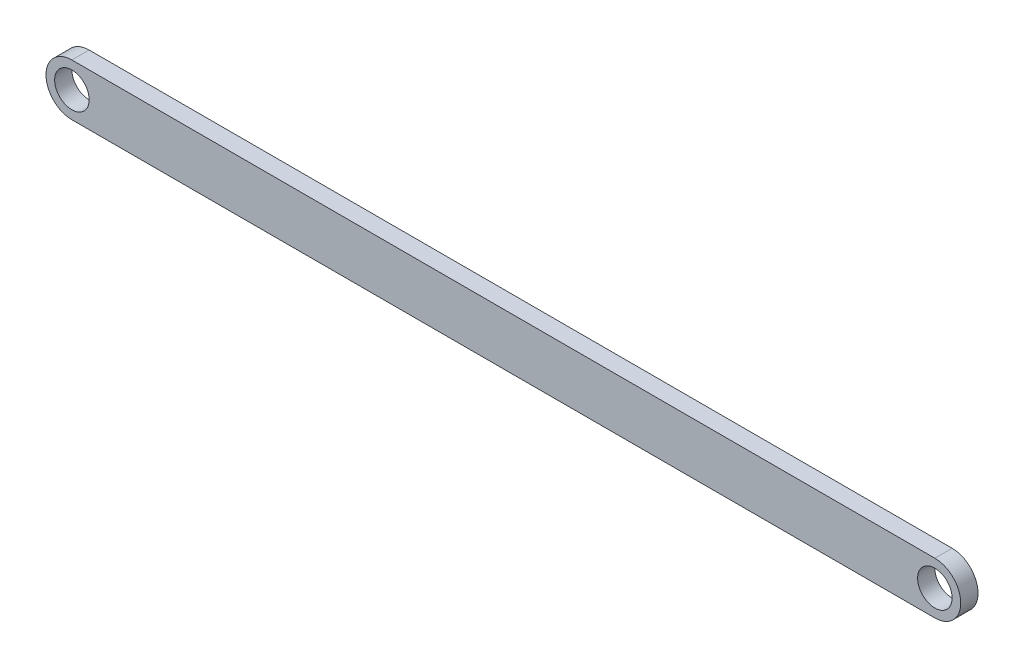
ISO-10303-21;
HEADER;
FILE_DESCRIPTION(('STEP AP214'),'2;1');
FILE_NAME('part.step','',(''),(''),'','','');
FILE_SCHEMA(('AUTOMOTIVE_DESIGN { 1 0 10303 214 1 1 1 1 }'));
ENDSEC;
DATA;
#1=APPLICATION_CONTEXT('core data for automotive mechanical design processes');
#2=APPLICATION_PROTOCOL_DEFINITION('international standard','automotive_design',2000,#1);
#3=PRODUCT_CONTEXT('',#1,'mechanical');
#4=PRODUCT('Part','Part','',(#3));
#5=PRODUCT_RELATED_PRODUCT_CATEGORY('part','',(#4));
#6=PRODUCT_DEFINITION_FORMATION('','',#4);
#7=PRODUCT_DEFINITION_CONTEXT('part definition',#1,'design');
#8=PRODUCT_DEFINITION('design','',#6,#7);
#9=PRODUCT_DEFINITION_SHAPE('','',#8);
#10=(LENGTH_UNIT() NAMED_UNIT(*) SI_UNIT(.MILLI.,.METRE.));
#11=(NAMED_UNIT(*) PLANE_ANGLE_UNIT() SI_UNIT($,.RADIAN.));
#12=(NAMED_UNIT(*) SI_UNIT($,.STERADIAN.) SOLID_ANGLE_UNIT());
#13=UNCERTAINTY_MEASURE_WITH_UNIT(LENGTH_MEASURE(1.E-05),#10,'distance_accuracy_value','');
#14=(GEOMETRIC_REPRESENTATION_CONTEXT(3) GLOBAL_UNCERTAINTY_ASSIGNED_CONTEXT((#13)) GLOBAL_UNIT_ASSIGNED_CONTEXT((#10,
#11,#12)) REPRESENTATION_CONTEXT('',''));
#15=CARTESIAN_POINT('',(0.,0.,0.));
#16=DIRECTION('',(0.,0.,1.));
#17=DIRECTION('',(1.,0.,0.));
#18=AXIS2_PLACEMENT_3D('',#15,#16,#17);
#19=CARTESIAN_POINT('',(-51.9553359155506,0.,2.));
#20=DIRECTION('',(0.,0.,1.));
#21=DIRECTION('',(1.,0.,0.));
#22=AXIS2_PLACEMENT_3D('',#19,#20,#21);
#23=PLANE('',#22);
#24=CARTESIAN_POINT('',(48.0446640844494,0.,2.));
#25=DIRECTION('',(0.,0.,1.));
#26=DIRECTION('',(1.,0.,0.));
#27=AXIS2_PLACEMENT_3D('',#24,#25,#26);
#28=CIRCLE('',#27,2.);
#29=CARTESIAN_POINT('',(50.0446640844494,0.,2.));
#30=VERTEX_POINT('',#29);
#31=EDGE_CURVE('E98',#30,#30,#28,.T.);
#32=ORIENTED_EDGE('',*,*,#31,.F.);
#33=EDGE_LOOP('',(#32));
#34=FACE_BOUND('',#33,.T.);
#35=CARTESIAN_POINT('',(-51.9553359155506,0.,2.));
#36=DIRECTION('',(0.,0.,1.));
#37=DIRECTION('',(1.,0.,0.));
#38=AXIS2_PLACEMENT_3D('',#35,#36,#37);
#39=CIRCLE('',#38,3.);
#40=CARTESIAN_POINT('',(-51.9553359155506,3.,2.));
#41=VERTEX_POINT('',#40);
#42=CARTESIAN_POINT('',(-51.9553359155506,-3.,2.));
#43=VERTEX_POINT('',#42);
#44=EDGE_CURVE('E83',#41,#43,#39,.T.);
#45=ORIENTED_EDGE('',*,*,#44,.T.);
#46=DIRECTION('',(1.,0.,0.));
#47=VECTOR('',#46,1.);
#48=CARTESIAN_POINT('',(-51.9553359155506,-3.,2.));
#49=LINE('',#48,#47);
#50=CARTESIAN_POINT('',(48.0446640844494,-3.,2.));
#51=VERTEX_POINT('',#50);
#52=EDGE_CURVE('E78',#43,#51,#49,.T.);
#53=ORIENTED_EDGE('',*,*,#52,.T.);
#54=CARTESIAN_POINT('',(48.0446640844494,0.,2.));
#55=DIRECTION('',(0.,0.,1.));
#56=DIRECTION('',(1.,0.,0.));
#57=AXIS2_PLACEMENT_3D('',#54,#55,#56);
#58=CIRCLE('',#57,3.);
#59=CARTESIAN_POINT('',(48.0446640844494,3.,2.));
#60=VERTEX_POINT('',#59);
#61=EDGE_CURVE('E81',#51,#60,#58,.T.);
#62=ORIENTED_EDGE('',*,*,#61,.T.);
#63=DIRECTION('',(-1.,0.,0.));
#64=VECTOR('',#63,1.);
#65=CARTESIAN_POINT('',(-51.9553359155506,3.,2.));
#66=LINE('',#65,#64);
#67=EDGE_CURVE('E48',#60,#41,#66,.T.);
#68=ORIENTED_EDGE('',*,*,#67,.T.);
#69=EDGE_LOOP('',(#45,#53,#62,#68));
#70=FACE_BOUND('',#69,.T.);
#71=CARTESIAN_POINT('',(-51.9553359155506,0.,2.));
#72=DIRECTION('',(0.,0.,1.));
#73=DIRECTION('',(1.,0.,0.));
#74=AXIS2_PLACEMENT_3D('',#71,#72,#73);
#75=CIRCLE('',#74,2.);
#76=CARTESIAN_POINT('',(-49.9553359155506,0.,2.));
#77=VERTEX_POINT('',#76);
#78=EDGE_CURVE('E113',#77,#77,#75,.T.);
#79=ORIENTED_EDGE('',*,*,#78,.F.);
#80=EDGE_LOOP('',(#79));
#81=FACE_BOUND('',#80,.T.);
#82=ADVANCED_FACE('F31',(#34,#70,#81),#23,.T.);
#83=CARTESIAN_POINT('',(-51.9553359155506,0.,0.));
#84=DIRECTION('',(0.,0.,1.));
#85=DIRECTION('',(1.,0.,0.));
#86=AXIS2_PLACEMENT_3D('',#83,#84,#85);
#87=PLANE('',#86);
#88=CARTESIAN_POINT('',(48.0446640844494,0.,0.));
#89=DIRECTION('',(0.,0.,1.));
#90=DIRECTION('',(1.,0.,0.));
#91=AXIS2_PLACEMENT_3D('',#88,#89,#90);
#92=CIRCLE('',#91,2.);
#93=CARTESIAN_POINT('',(50.0446640844494,0.,0.));
#94=VERTEX_POINT('',#93);
#95=EDGE_CURVE('E110',#94,#94,#92,.T.);
#96=ORIENTED_EDGE('',*,*,#95,.T.);
#97=EDGE_LOOP('',(#96));
#98=FACE_BOUND('',#97,.T.);
#99=CARTESIAN_POINT('',(-51.9553359155506,0.,0.));
#100=DIRECTION('',(0.,0.,1.));
#101=DIRECTION('',(1.,0.,0.));
#102=AXIS2_PLACEMENT_3D('',#99,#100,#101);
#103=CIRCLE('',#102,3.);
#104=CARTESIAN_POINT('',(-51.9553359155506,3.,0.));
#105=VERTEX_POINT('',#104);
#106=CARTESIAN_POINT('',(-51.9553359155506,-3.,0.));
#107=VERTEX_POINT('',#106);
#108=EDGE_CURVE('E95',#105,#107,#103,.T.);
#109=ORIENTED_EDGE('',*,*,#108,.F.);
#110=DIRECTION('',(-1.,0.,0.));
#111=VECTOR('',#110,1.);
#112=CARTESIAN_POINT('',(-51.9553359155506,3.,0.));
#113=LINE('',#112,#111);
#114=CARTESIAN_POINT('',(48.0446640844494,3.,0.));
#115=VERTEX_POINT('',#114);
#116=EDGE_CURVE('E71',#115,#105,#113,.T.);
#117=ORIENTED_EDGE('',*,*,#116,.F.);
#118=CARTESIAN_POINT('',(48.0446640844494,0.,0.));
#119=DIRECTION('',(0.,0.,1.));
#120=DIRECTION('',(1.,0.,0.));
#121=AXIS2_PLACEMENT_3D('',#118,#119,#120);
#122=CIRCLE('',#121,3.);
#123=CARTESIAN_POINT('',(48.0446640844494,-3.,0.));
#124=VERTEX_POINT('',#123);
#125=EDGE_CURVE('E65',#124,#115,#122,.T.);
#126=ORIENTED_EDGE('',*,*,#125,.F.);
#127=DIRECTION('',(1.,0.,0.));
#128=VECTOR('',#127,1.);
#129=CARTESIAN_POINT('',(-51.9553359155506,-3.,0.));
#130=LINE('',#129,#128);
#131=EDGE_CURVE('E87',#107,#124,#130,.T.);
#132=ORIENTED_EDGE('',*,*,#131,.F.);
#133=EDGE_LOOP('',(#109,#117,#126,#132));
#134=FACE_BOUND('',#133,.T.);
#135=CARTESIAN_POINT('',(-51.9553359155506,0.,0.));
#136=DIRECTION('',(0.,0.,1.));
#137=DIRECTION('',(1.,0.,0.));
#138=AXIS2_PLACEMENT_3D('',#135,#136,#137);
#139=CIRCLE('',#138,2.);
#140=CARTESIAN_POINT('',(-49.9553359155506,0.,0.));
#141=VERTEX_POINT('',#140);
#142=EDGE_CURVE('E116',#141,#141,#139,.T.);
#143=ORIENTED_EDGE('',*,*,#142,.T.);
#144=EDGE_LOOP('',(#143));
#145=FACE_BOUND('',#144,.T.);
#146=ADVANCED_FACE('F106',(#98,#134,#145),#87,.F.);
#147=CARTESIAN_POINT('',(-51.9553359155506,0.,2.));
#148=DIRECTION('',(0.,0.,-1.));
#149=DIRECTION('',(-1.,0.,0.));
#150=AXIS2_PLACEMENT_3D('',#147,#148,#149);
#151=CYLINDRICAL_SURFACE('',#150,3.);
#152=ORIENTED_EDGE('',*,*,#108,.T.);
#153=DIRECTION('',(0.,0.,-1.));
#154=VECTOR('',#153,1.);
#155=CARTESIAN_POINT('',(-51.9553359155506,-3.,2.));
#156=LINE('',#155,#154);
#157=EDGE_CURVE('E11',#43,#107,#156,.T.);
#158=ORIENTED_EDGE('',*,*,#157,.F.);
#159=ORIENTED_EDGE('',*,*,#44,.F.);
#160=DIRECTION('',(0.,0.,-1.));
#161=VECTOR('',#160,1.);
#162=CARTESIAN_POINT('',(-51.9553359155506,3.,2.));
#163=LINE('',#162,#161);
#164=EDGE_CURVE('E91',#41,#105,#163,.T.);
#165=ORIENTED_EDGE('',*,*,#164,.T.);
#166=EDGE_LOOP('',(#152,#158,#159,#165));
#167=FACE_BOUND('',#166,.T.);
#168=ADVANCED_FACE('F33',(#167),#151,.T.);
#169=CARTESIAN_POINT('',(-51.9553359155506,-3.,2.));
#170=DIRECTION('',(0.,1.,0.));
#171=DIRECTION('',(0.,0.,1.));
#172=AXIS2_PLACEMENT_3D('',#169,#170,#171);
#173=PLANE('',#172);
#174=ORIENTED_EDGE('',*,*,#131,.T.);
#175=DIRECTION('',(0.,0.,-1.));
#176=VECTOR('',#175,1.);
#177=CARTESIAN_POINT('',(48.0446640844494,-3.,2.));
#178=LINE('',#177,#176);
#179=EDGE_CURVE('E40',#51,#124,#178,.T.);
#180=ORIENTED_EDGE('',*,*,#179,.F.);
#181=ORIENTED_EDGE('',*,*,#52,.F.);
#182=ORIENTED_EDGE('',*,*,#157,.T.);
#183=EDGE_LOOP('',(#174,#180,#181,#182));
#184=FACE_BOUND('',#183,.T.);
#185=ADVANCED_FACE('F86',(#184),#173,.F.);
#186=CARTESIAN_POINT('',(48.0446640844494,0.,2.));
#187=DIRECTION('',(0.,0.,-1.));
#188=DIRECTION('',(-1.,0.,0.));
#189=AXIS2_PLACEMENT_3D('',#186,#187,#188);
#190=CYLINDRICAL_SURFACE('',#189,3.);
#191=ORIENTED_EDGE('',*,*,#125,.T.);
#192=DIRECTION('',(0.,0.,-1.));
#193=VECTOR('',#192,1.);
#194=CARTESIAN_POINT('',(48.0446640844494,3.,2.));
#195=LINE('',#194,#193);
#196=EDGE_CURVE('E88',#60,#115,#195,.T.);
#197=ORIENTED_EDGE('',*,*,#196,.F.);
#198=ORIENTED_EDGE('',*,*,#61,.F.);
#199=ORIENTED_EDGE('',*,*,#179,.T.);
#200=EDGE_LOOP('',(#191,#197,#198,#199));
#201=FACE_BOUND('',#200,.T.);
#202=ADVANCED_FACE('F89',(#201),#190,.T.);
#203=CARTESIAN_POINT('',(-51.9553359155506,3.,2.));
#204=DIRECTION('',(0.,-1.,0.));
#205=DIRECTION('',(0.,0.,-1.));
#206=AXIS2_PLACEMENT_3D('',#203,#204,#205);
#207=PLANE('',#206);
#208=ORIENTED_EDGE('',*,*,#116,.T.);
#209=ORIENTED_EDGE('',*,*,#164,.F.);
#210=ORIENTED_EDGE('',*,*,#67,.F.);
#211=ORIENTED_EDGE('',*,*,#196,.T.);
#212=EDGE_LOOP('',(#208,#209,#210,#211));
#213=FACE_BOUND('',#212,.T.);
#214=ADVANCED_FACE('F103',(#213),#207,.F.);
#215=CARTESIAN_POINT('',(48.0446640844494,0.,2.));
#216=DIRECTION('',(0.,0.,-1.));
#217=DIRECTION('',(-1.,0.,0.));
#218=AXIS2_PLACEMENT_3D('',#215,#216,#217);
#219=CYLINDRICAL_SURFACE('',#218,2.);
#220=ORIENTED_EDGE('',*,*,#31,.T.);
#221=EDGE_LOOP('',(#220));
#222=FACE_BOUND('',#221,.T.);
#223=ORIENTED_EDGE('',*,*,#95,.F.);
#224=EDGE_LOOP('',(#223));
#225=FACE_BOUND('',#224,.T.);
#226=ADVANCED_FACE('F134',(#222,#225),#219,.F.);
#227=CARTESIAN_POINT('',(-51.9553359155506,0.,2.));
#228=DIRECTION('',(0.,0.,-1.));
#229=DIRECTION('',(-1.,0.,0.));
#230=AXIS2_PLACEMENT_3D('',#227,#228,#229);
#231=CYLINDRICAL_SURFACE('',#230,2.);
#232=ORIENTED_EDGE('',*,*,#78,.T.);
#233=EDGE_LOOP('',(#232));
#234=FACE_BOUND('',#233,.T.);
#235=ORIENTED_EDGE('',*,*,#142,.F.);
#236=EDGE_LOOP('',(#235));
#237=FACE_BOUND('',#236,.T.);
#238=ADVANCED_FACE('F122',(#234,#237),#231,.F.);
#239=CLOSED_SHELL('',(#82,#146,#168,#185,#202,#214,#226,#238));
#240=MANIFOLD_SOLID_BREP('B2',#239);
#241=ADVANCED_BREP_SHAPE_REPRESENTATION('',(#18,#240),#14);
#242=SHAPE_DEFINITION_REPRESENTATION(#9,#241);
ENDSEC;
END-ISO-10303-21;
